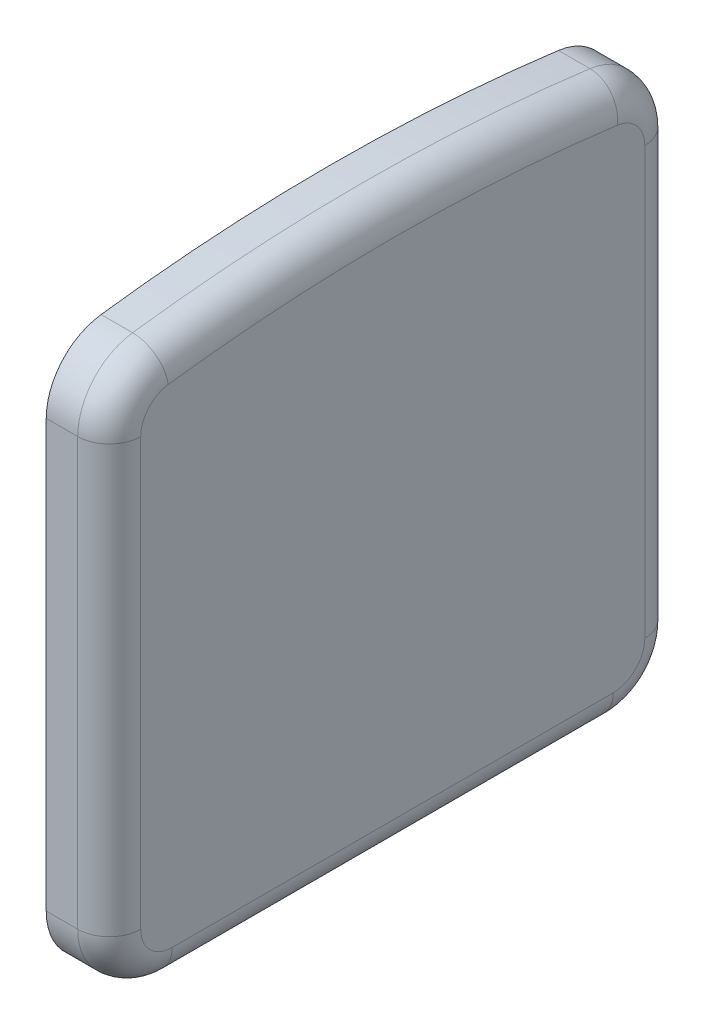
ISO-10303-21;
HEADER;
FILE_DESCRIPTION(('STEP AP214'),'2;1');
FILE_NAME('part.step','',(''),(''),'','','');
FILE_SCHEMA(('AUTOMOTIVE_DESIGN { 1 0 10303 214 1 1 1 1 }'));
ENDSEC;
DATA;
#1=APPLICATION_CONTEXT('core data for automotive mechanical design processes');
#2=APPLICATION_PROTOCOL_DEFINITION('international standard','automotive_design',2000,#1);
#3=PRODUCT_CONTEXT('',#1,'mechanical');
#4=PRODUCT('Part','Part','',(#3));
#5=PRODUCT_RELATED_PRODUCT_CATEGORY('part','',(#4));
#6=PRODUCT_DEFINITION_FORMATION('','',#4);
#7=PRODUCT_DEFINITION_CONTEXT('part definition',#1,'design');
#8=PRODUCT_DEFINITION('design','',#6,#7);
#9=PRODUCT_DEFINITION_SHAPE('','',#8);
#10=(LENGTH_UNIT() NAMED_UNIT(*) SI_UNIT(.MILLI.,.METRE.));
#11=(NAMED_UNIT(*) PLANE_ANGLE_UNIT() SI_UNIT($,.RADIAN.));
#12=(NAMED_UNIT(*) SI_UNIT($,.STERADIAN.) SOLID_ANGLE_UNIT());
#13=UNCERTAINTY_MEASURE_WITH_UNIT(LENGTH_MEASURE(1.E-05),#10,'distance_accuracy_value','');
#14=(GEOMETRIC_REPRESENTATION_CONTEXT(3) GLOBAL_UNCERTAINTY_ASSIGNED_CONTEXT((#13)) GLOBAL_UNIT_ASSIGNED_CONTEXT((#10,
#11,#12)) REPRESENTATION_CONTEXT('',''));
#15=CARTESIAN_POINT('',(0.,0.,0.));
#16=DIRECTION('',(0.,0.,1.));
#17=DIRECTION('',(1.,0.,0.));
#18=AXIS2_PLACEMENT_3D('',#15,#16,#17);
#19=CARTESIAN_POINT('',(14.999,-80.001,-4.50000000000003));
#20=DIRECTION('',(0.,0.,-1.));
#21=DIRECTION('',(0.,1.,0.));
#22=AXIS2_PLACEMENT_3D('',#19,#20,#21);
#23=PLANE('',#22);
#24=DIRECTION('',(0.,-1.,0.));
#25=VECTOR('',#24,1.);
#26=CARTESIAN_POINT('',(15.,-76.3808696074614,-4.50000000000003));
#27=LINE('',#26,#25);
#28=CARTESIAN_POINT('',(15.,-73.2278129395449,-4.50000000000002));
#29=VERTEX_POINT('',#28);
#30=CARTESIAN_POINT('',(15.,-80.,-4.50000000000003));
#31=VERTEX_POINT('',#30);
#32=EDGE_CURVE('E209',#29,#31,#27,.T.);
#33=ORIENTED_EDGE('',*,*,#32,.F.);
#34=DIRECTION('',(-1.,0.,0.));
#35=VECTOR('',#34,1.);
#36=CARTESIAN_POINT('',(15.25,-73.2278129395449,-4.50000000000002));
#37=LINE('',#36,#35);
#38=CARTESIAN_POINT('',(15.5,-73.2278129395449,-4.50000000000003));
#39=VERTEX_POINT('',#38);
#40=EDGE_CURVE('E239',#39,#29,#37,.T.);
#41=ORIENTED_EDGE('',*,*,#40,.F.);
#42=DIRECTION('',(0.,1.,0.));
#43=VECTOR('',#42,1.);
#44=CARTESIAN_POINT('',(15.5,-76.6139064697724,-4.50000000000003));
#45=LINE('',#44,#43);
#46=CARTESIAN_POINT('',(15.5,-80.,-4.50000000000003));
#47=VERTEX_POINT('',#46);
#48=EDGE_CURVE('E192',#47,#39,#45,.T.);
#49=ORIENTED_EDGE('',*,*,#48,.F.);
#50=DIRECTION('',(1.,0.,0.));
#51=VECTOR('',#50,1.);
#52=CARTESIAN_POINT('',(15.25,-80.,-4.50000000000003));
#53=LINE('',#52,#51);
#54=EDGE_CURVE('E198',#31,#47,#53,.T.);
#55=ORIENTED_EDGE('',*,*,#54,.F.);
#56=EDGE_LOOP('',(#33,#41,#49,#55));
#57=FACE_BOUND('',#56,.T.);
#58=ADVANCED_FACE('F17',(#57),#23,.T.);
#59=CARTESIAN_POINT('',(15.5,-73.2278129395449,-3.50000000000007));
#60=DIRECTION('',(-1.,0.,0.));
#61=DIRECTION('',(0.,0.,1.));
#62=AXIS2_PLACEMENT_3D('',#59,#60,#61);
#63=CYLINDRICAL_SURFACE('',#62,0.999999999999983);
#64=CARTESIAN_POINT('',(15.,-73.2278129395449,-3.50000000000007));
#65=DIRECTION('',(-1.,0.,0.));
#66=DIRECTION('',(0.,0.,1.));
#67=AXIS2_PLACEMENT_3D('',#64,#65,#66);
#68=CIRCLE('',#67,0.999999999999983);
#69=CARTESIAN_POINT('',(15.,-72.2362504558243,-3.62962962962966));
#70=VERTEX_POINT('',#69);
#71=EDGE_CURVE('E211',#70,#29,#68,.T.);
#72=ORIENTED_EDGE('',*,*,#71,.F.);
#73=DIRECTION('',(-1.,0.,0.));
#74=VECTOR('',#73,1.);
#75=CARTESIAN_POINT('',(15.25,-72.2362504558243,-3.62962962962965));
#76=LINE('',#75,#74);
#77=CARTESIAN_POINT('',(15.5,-72.2362504558243,-3.62962962962965));
#78=VERTEX_POINT('',#77);
#79=EDGE_CURVE('E232',#78,#70,#76,.T.);
#80=ORIENTED_EDGE('',*,*,#79,.F.);
#81=CARTESIAN_POINT('',(15.5,-73.2278129395449,-3.50000000000007));
#82=DIRECTION('',(1.,0.,0.));
#83=DIRECTION('',(0.,0.,-1.));
#84=AXIS2_PLACEMENT_3D('',#81,#82,#83);
#85=CIRCLE('',#84,0.999999999999983);
#86=EDGE_CURVE('E186',#39,#78,#85,.T.);
#87=ORIENTED_EDGE('',*,*,#86,.F.);
#88=ORIENTED_EDGE('',*,*,#40,.T.);
#89=EDGE_LOOP('',(#72,#80,#87,#88));
#90=FACE_BOUND('',#89,.T.);
#91=ADVANCED_FACE('F332',(#90),#63,.T.);
#92=CARTESIAN_POINT('',(15.5,-100.000000000005,0.));
#93=DIRECTION('',(-1.,0.,0.));
#94=DIRECTION('',(0.,0.,1.));
#95=AXIS2_PLACEMENT_3D('',#92,#93,#94);
#96=CYLINDRICAL_SURFACE('',#95,28.0000000000055);
#97=CARTESIAN_POINT('',(15.,-100.000000000005,0.));
#98=DIRECTION('',(-1.,0.,0.));
#99=DIRECTION('',(0.,0.,1.));
#100=AXIS2_PLACEMENT_3D('',#97,#98,#99);
#101=CIRCLE('',#100,28.0000000000055);
#102=CARTESIAN_POINT('',(15.,-72.2362504558243,3.62962962962961));
#103=VERTEX_POINT('',#102);
#104=EDGE_CURVE('E252',#103,#70,#101,.T.);
#105=ORIENTED_EDGE('',*,*,#104,.F.);
#106=DIRECTION('',(-1.,0.,0.));
#107=VECTOR('',#106,1.);
#108=CARTESIAN_POINT('',(15.25,-72.2362504558243,3.6296296296296));
#109=LINE('',#108,#107);
#110=CARTESIAN_POINT('',(15.5,-72.2362504558243,3.6296296296296));
#111=VERTEX_POINT('',#110);
#112=EDGE_CURVE('E225',#111,#103,#109,.T.);
#113=ORIENTED_EDGE('',*,*,#112,.F.);
#114=CARTESIAN_POINT('',(15.5,-99.9999999999999,0.));
#115=DIRECTION('',(1.,0.,0.));
#116=DIRECTION('',(0.,0.991562483720559,-0.129629629629632));
#117=AXIS2_PLACEMENT_3D('',#114,#115,#116);
#118=CIRCLE('',#117,27.9999999999999);
#119=EDGE_CURVE('E180',#78,#111,#118,.T.);
#120=ORIENTED_EDGE('',*,*,#119,.F.);
#121=ORIENTED_EDGE('',*,*,#79,.T.);
#122=EDGE_LOOP('',(#105,#113,#120,#121));
#123=FACE_BOUND('',#122,.T.);
#124=ADVANCED_FACE('F328',(#123),#96,.T.);
#125=CARTESIAN_POINT('',(15.5,-73.2278129395449,3.50000000000002));
#126=DIRECTION('',(-1.,0.,0.));
#127=DIRECTION('',(0.,0.,1.));
#128=AXIS2_PLACEMENT_3D('',#125,#126,#127);
#129=CYLINDRICAL_SURFACE('',#128,0.999999999999992);
#130=CARTESIAN_POINT('',(15.,-73.2278129395449,3.50000000000002));
#131=DIRECTION('',(-1.,0.,0.));
#132=DIRECTION('',(0.,0.,1.));
#133=AXIS2_PLACEMENT_3D('',#130,#131,#132);
#134=CIRCLE('',#133,0.999999999999992);
#135=CARTESIAN_POINT('',(15.,-73.2278129395449,4.49999999999997));
#136=VERTEX_POINT('',#135);
#137=EDGE_CURVE('E215',#136,#103,#134,.T.);
#138=ORIENTED_EDGE('',*,*,#137,.F.);
#139=DIRECTION('',(-1.,0.,0.));
#140=VECTOR('',#139,1.);
#141=CARTESIAN_POINT('',(15.25,-73.2278129395449,4.49999999999997));
#142=LINE('',#141,#140);
#143=CARTESIAN_POINT('',(15.5,-73.2278129395449,4.49999999999997));
#144=VERTEX_POINT('',#143);
#145=EDGE_CURVE('E218',#144,#136,#142,.T.);
#146=ORIENTED_EDGE('',*,*,#145,.F.);
#147=CARTESIAN_POINT('',(15.5,-73.2278129395449,3.49999999999989));
#148=DIRECTION('',(1.,0.,0.));
#149=DIRECTION('',(0.,0.99156248372055,0.129629629629703));
#150=AXIS2_PLACEMENT_3D('',#147,#148,#149);
#151=CIRCLE('',#150,1.00000000000006);
#152=EDGE_CURVE('E176',#111,#144,#151,.T.);
#153=ORIENTED_EDGE('',*,*,#152,.F.);
#154=ORIENTED_EDGE('',*,*,#112,.T.);
#155=EDGE_LOOP('',(#138,#146,#153,#154));
#156=FACE_BOUND('',#155,.T.);
#157=ADVANCED_FACE('F324',(#156),#129,.T.);
#158=CARTESIAN_POINT('',(14.999,-73.2268129395449,4.49999999999997));
#159=DIRECTION('',(0.,0.,1.));
#160=DIRECTION('',(0.,-1.,0.));
#161=AXIS2_PLACEMENT_3D('',#158,#159,#160);
#162=PLANE('',#161);
#163=DIRECTION('',(0.,1.,0.));
#164=VECTOR('',#163,1.);
#165=CARTESIAN_POINT('',(15.,-76.3808696074614,4.49999999999997));
#166=LINE('',#165,#164);
#167=CARTESIAN_POINT('',(15.,-80.,4.49999999999997));
#168=VERTEX_POINT('',#167);
#169=EDGE_CURVE('E212',#168,#136,#166,.T.);
#170=ORIENTED_EDGE('',*,*,#169,.F.);
#171=DIRECTION('',(-1.,0.,0.));
#172=VECTOR('',#171,1.);
#173=CARTESIAN_POINT('',(15.25,-80.,4.49999999999997));
#174=LINE('',#173,#172);
#175=CARTESIAN_POINT('',(15.5,-80.,4.49999999999997));
#176=VERTEX_POINT('',#175);
#177=EDGE_CURVE('E216',#176,#168,#174,.T.);
#178=ORIENTED_EDGE('',*,*,#177,.F.);
#179=DIRECTION('',(0.,-1.,0.));
#180=VECTOR('',#179,1.);
#181=CARTESIAN_POINT('',(15.5,-76.6139064697725,4.49999999999997));
#182=LINE('',#181,#180);
#183=EDGE_CURVE('E172',#144,#176,#182,.T.);
#184=ORIENTED_EDGE('',*,*,#183,.F.);
#185=ORIENTED_EDGE('',*,*,#145,.T.);
#186=EDGE_LOOP('',(#170,#178,#184,#185));
#187=FACE_BOUND('',#186,.T.);
#188=ADVANCED_FACE('F321',(#187),#162,.T.);
#189=CARTESIAN_POINT('',(15.5,-80.,3.49999999999997));
#190=DIRECTION('',(-1.,0.,0.));
#191=DIRECTION('',(0.,0.,1.));
#192=AXIS2_PLACEMENT_3D('',#189,#190,#191);
#193=CYLINDRICAL_SURFACE('',#192,1.);
#194=CARTESIAN_POINT('',(15.,-80.,3.49999999999997));
#195=DIRECTION('',(-1.,0.,0.));
#196=DIRECTION('',(0.,0.,1.));
#197=AXIS2_PLACEMENT_3D('',#194,#195,#196);
#198=CIRCLE('',#197,1.);
#199=CARTESIAN_POINT('',(15.,-81.,3.49999999999997));
#200=VERTEX_POINT('',#199);
#201=EDGE_CURVE('E126',#200,#168,#198,.T.);
#202=ORIENTED_EDGE('',*,*,#201,.F.);
#203=DIRECTION('',(-1.,0.,0.));
#204=VECTOR('',#203,1.);
#205=CARTESIAN_POINT('',(15.25,-81.,3.49999999999997));
#206=LINE('',#205,#204);
#207=CARTESIAN_POINT('',(15.5,-81.,3.49999999999997));
#208=VERTEX_POINT('',#207);
#209=EDGE_CURVE('E121',#208,#200,#206,.T.);
#210=ORIENTED_EDGE('',*,*,#209,.F.);
#211=CARTESIAN_POINT('',(15.5,-80.,3.49999999999998));
#212=DIRECTION('',(1.,0.,0.));
#213=DIRECTION('',(0.,0.,1.));
#214=AXIS2_PLACEMENT_3D('',#211,#212,#213);
#215=CIRCLE('',#214,0.999999999999982);
#216=EDGE_CURVE('E124',#176,#208,#215,.T.);
#217=ORIENTED_EDGE('',*,*,#216,.F.);
#218=ORIENTED_EDGE('',*,*,#177,.T.);
#219=EDGE_LOOP('',(#202,#210,#217,#218));
#220=FACE_BOUND('',#219,.T.);
#221=ADVANCED_FACE('F123',(#220),#193,.T.);
#222=CARTESIAN_POINT('',(15.,-81.001,4.50099999999998));
#223=DIRECTION('',(-1.,0.,0.));
#224=DIRECTION('',(0.,1.,0.));
#225=AXIS2_PLACEMENT_3D('',#222,#223,#224);
#226=PLANE('',#225);
#227=CARTESIAN_POINT('',(15.,-80.,-3.50000000000006));
#228=DIRECTION('',(-1.,0.,0.));
#229=DIRECTION('',(0.,0.,1.));
#230=AXIS2_PLACEMENT_3D('',#227,#228,#229);
#231=CIRCLE('',#230,0.999999999999975);
#232=CARTESIAN_POINT('',(15.,-81.,-3.50000000000005));
#233=VERTEX_POINT('',#232);
#234=EDGE_CURVE('E201',#233,#31,#231,.F.);
#235=ORIENTED_EDGE('',*,*,#234,.F.);
#236=DIRECTION('',(0.,0.,-1.));
#237=VECTOR('',#236,1.);
#238=CARTESIAN_POINT('',(15.,-81.,0.));
#239=LINE('',#238,#237);
#240=EDGE_CURVE('E131',#200,#233,#239,.T.);
#241=ORIENTED_EDGE('',*,*,#240,.F.);
#242=ORIENTED_EDGE('',*,*,#201,.T.);
#243=ORIENTED_EDGE('',*,*,#169,.T.);
#244=ORIENTED_EDGE('',*,*,#137,.T.);
#245=ORIENTED_EDGE('',*,*,#104,.T.);
#246=ORIENTED_EDGE('',*,*,#71,.T.);
#247=ORIENTED_EDGE('',*,*,#32,.T.);
#248=EDGE_LOOP('',(#235,#241,#242,#243,#244,#245,#246,#247));
#249=FACE_BOUND('',#248,.T.);
#250=ADVANCED_FACE('F315',(#249),#226,.T.);
#251=CARTESIAN_POINT('',(15.5,-80.,-3.50000000000006));
#252=DIRECTION('',(-1.,0.,0.));
#253=DIRECTION('',(0.,0.,1.));
#254=AXIS2_PLACEMENT_3D('',#251,#252,#253);
#255=CYLINDRICAL_SURFACE('',#254,0.999999999999975);
#256=ORIENTED_EDGE('',*,*,#234,.T.);
#257=ORIENTED_EDGE('',*,*,#54,.T.);
#258=CARTESIAN_POINT('',(15.5,-80.,-3.50000000000005));
#259=DIRECTION('',(1.,0.,0.));
#260=DIRECTION('',(0.,-1.,0.));
#261=AXIS2_PLACEMENT_3D('',#258,#259,#260);
#262=CIRCLE('',#261,0.999999999999976);
#263=CARTESIAN_POINT('',(15.5,-81.,-3.50000000000003));
#264=VERTEX_POINT('',#263);
#265=EDGE_CURVE('E156',#264,#47,#262,.T.);
#266=ORIENTED_EDGE('',*,*,#265,.F.);
#267=DIRECTION('',(1.,0.,0.));
#268=VECTOR('',#267,1.);
#269=CARTESIAN_POINT('',(15.25,-81.,-3.50000000000003));
#270=LINE('',#269,#268);
#271=EDGE_CURVE('E144',#233,#264,#270,.T.);
#272=ORIENTED_EDGE('',*,*,#271,.F.);
#273=EDGE_LOOP('',(#256,#257,#266,#272));
#274=FACE_BOUND('',#273,.T.);
#275=ADVANCED_FACE('F277',(#274),#255,.T.);
#276=CARTESIAN_POINT('',(15.5,-73.2278129395449,-4.00000000000003));
#277=DIRECTION('',(0.,-1.,0.));
#278=DIRECTION('',(0.,0.,-1.));
#279=AXIS2_PLACEMENT_3D('',#276,#277,#278);
#280=CYLINDRICAL_SURFACE('',#279,0.5);
#281=CARTESIAN_POINT('',(15.5,-80.,-4.00000000000003));
#282=DIRECTION('',(0.,-1.,0.));
#283=DIRECTION('',(1.,0.,0.));
#284=AXIS2_PLACEMENT_3D('',#281,#282,#283);
#285=CIRCLE('',#284,0.500000000000001);
#286=CARTESIAN_POINT('',(16.,-80.,-4.00000000000003));
#287=VERTEX_POINT('',#286);
#288=EDGE_CURVE('E159',#47,#287,#285,.T.);
#289=ORIENTED_EDGE('',*,*,#288,.F.);
#290=ORIENTED_EDGE('',*,*,#48,.T.);
#291=CARTESIAN_POINT('',(15.5,-73.2278129395449,-4.00000000000002));
#292=DIRECTION('',(0.,1.,0.));
#293=DIRECTION('',(1.,0.,0.));
#294=AXIS2_PLACEMENT_3D('',#291,#292,#293);
#295=CIRCLE('',#294,0.500000000000001);
#296=CARTESIAN_POINT('',(16.,-73.2278129395449,-4.00000000000002));
#297=VERTEX_POINT('',#296);
#298=EDGE_CURVE('E189',#297,#39,#295,.T.);
#299=ORIENTED_EDGE('',*,*,#298,.F.);
#300=DIRECTION('',(0.,1.,0.));
#301=VECTOR('',#300,1.);
#302=CARTESIAN_POINT('',(16.,-76.3829969358996,-4.00000000000003));
#303=LINE('',#302,#301);
#304=EDGE_CURVE('E260',#287,#297,#303,.T.);
#305=ORIENTED_EDGE('',*,*,#304,.F.);
#306=EDGE_LOOP('',(#289,#290,#299,#305));
#307=FACE_BOUND('',#306,.T.);
#308=ADVANCED_FACE('F283',(#307),#280,.T.);
#309=CARTESIAN_POINT('',(15.5,-73.2278129395449,-3.49999999999998));
#310=DIRECTION('',(1.,0.,0.));
#311=DIRECTION('',(0.,0.,-1.));
#312=AXIS2_PLACEMENT_3D('',#309,#310,#311);
#313=TOROIDAL_SURFACE('',#312,0.500000000000046,0.500000000000001);
#314=ORIENTED_EDGE('',*,*,#298,.T.);
#315=ORIENTED_EDGE('',*,*,#86,.T.);
#316=CARTESIAN_POINT('',(15.5,-72.7320316976846,-3.56481481481484));
#317=DIRECTION('',(0.,0.129629629629622,0.991562483720561));
#318=DIRECTION('',(1.,0.,0.));
#319=AXIS2_PLACEMENT_3D('',#316,#317,#318);
#320=CIRCLE('',#319,0.499999999999991);
#321=CARTESIAN_POINT('',(16.,-72.7320316976846,-3.56481481481481));
#322=VERTEX_POINT('',#321);
#323=EDGE_CURVE('E183',#322,#78,#320,.T.);
#324=ORIENTED_EDGE('',*,*,#323,.F.);
#325=CARTESIAN_POINT('',(16.,-73.2278129395449,-3.49999999999998));
#326=DIRECTION('',(1.,0.,0.));
#327=DIRECTION('',(0.,0.,-1.));
#328=AXIS2_PLACEMENT_3D('',#325,#326,#327);
#329=CIRCLE('',#328,0.500000000000046);
#330=EDGE_CURVE('E261',#297,#322,#329,.T.);
#331=ORIENTED_EDGE('',*,*,#330,.F.);
#332=EDGE_LOOP('',(#314,#315,#324,#331));
#333=FACE_BOUND('',#332,.T.);
#334=ADVANCED_FACE('F307',(#333),#313,.T.);
#335=CARTESIAN_POINT('',(15.4999999999998,-100.000000000007,0.));
#336=DIRECTION('',(1.,0.,0.));
#337=DIRECTION('',(0.,1.,0.));
#338=AXIS2_PLACEMENT_3D('',#335,#336,#337);
#339=TOROIDAL_SURFACE('',#338,27.5000000000073,0.499999999999991);
#340=ORIENTED_EDGE('',*,*,#323,.T.);
#341=ORIENTED_EDGE('',*,*,#119,.T.);
#342=CARTESIAN_POINT('',(15.5,-72.7320316976846,3.56481481481478));
#343=DIRECTION('',(0.,-0.129629629629642,0.991562483720558));
#344=DIRECTION('',(1.,0.,0.));
#345=AXIS2_PLACEMENT_3D('',#342,#343,#344);
#346=CIRCLE('',#345,0.499999999999994);
#347=CARTESIAN_POINT('',(16.,-72.7320316976846,3.56481481481475));
#348=VERTEX_POINT('',#347);
#349=EDGE_CURVE('E59',#348,#111,#346,.T.);
#350=ORIENTED_EDGE('',*,*,#349,.F.);
#351=CARTESIAN_POINT('',(16.,-100.000000000007,0.));
#352=DIRECTION('',(1.,0.,0.));
#353=DIRECTION('',(0.,1.,0.));
#354=AXIS2_PLACEMENT_3D('',#351,#352,#353);
#355=CIRCLE('',#354,27.5000000000073);
#356=EDGE_CURVE('E263',#322,#348,#355,.T.);
#357=ORIENTED_EDGE('',*,*,#356,.F.);
#358=EDGE_LOOP('',(#340,#341,#350,#357));
#359=FACE_BOUND('',#358,.T.);
#360=ADVANCED_FACE('F304',(#359),#339,.T.);
#361=CARTESIAN_POINT('',(15.5,-73.2278129395449,3.49999999999991));
#362=DIRECTION('',(1.,0.,0.));
#363=DIRECTION('',(0.,0.,-1.));
#364=AXIS2_PLACEMENT_3D('',#361,#362,#363);
#365=TOROIDAL_SURFACE('',#364,0.500000000000051,0.499999999999994);
#366=CARTESIAN_POINT('',(15.5,-73.2278129395449,3.99999999999997));
#367=DIRECTION('',(0.,-1.,0.));
#368=DIRECTION('',(1.,0.,0.));
#369=AXIS2_PLACEMENT_3D('',#366,#367,#368);
#370=CIRCLE('',#369,0.5);
#371=CARTESIAN_POINT('',(16.,-73.2278129395449,3.99999999999997));
#372=VERTEX_POINT('',#371);
#373=EDGE_CURVE('E66',#372,#144,#370,.T.);
#374=ORIENTED_EDGE('',*,*,#373,.F.);
#375=CARTESIAN_POINT('',(16.,-73.2278129395449,3.49999999999991));
#376=DIRECTION('',(1.,0.,0.));
#377=DIRECTION('',(0.,0.,-1.));
#378=AXIS2_PLACEMENT_3D('',#375,#376,#377);
#379=CIRCLE('',#378,0.500000000000051);
#380=EDGE_CURVE('E21',#348,#372,#379,.T.);
#381=ORIENTED_EDGE('',*,*,#380,.F.);
#382=ORIENTED_EDGE('',*,*,#349,.T.);
#383=ORIENTED_EDGE('',*,*,#152,.T.);
#384=EDGE_LOOP('',(#374,#381,#382,#383));
#385=FACE_BOUND('',#384,.T.);
#386=ADVANCED_FACE('F301',(#385),#365,.T.);
#387=CARTESIAN_POINT('',(15.5,-80.,3.99999999999997));
#388=DIRECTION('',(0.,1.,0.));
#389=DIRECTION('',(0.,0.,1.));
#390=AXIS2_PLACEMENT_3D('',#387,#388,#389);
#391=CYLINDRICAL_SURFACE('',#390,0.5);
#392=CARTESIAN_POINT('',(15.5,-80.,3.99999999999997));
#393=DIRECTION('',(0.,-1.,0.));
#394=DIRECTION('',(1.,0.,0.));
#395=AXIS2_PLACEMENT_3D('',#392,#393,#394);
#396=CIRCLE('',#395,0.500000000000002);
#397=CARTESIAN_POINT('',(16.,-80.,3.99999999999997));
#398=VERTEX_POINT('',#397);
#399=EDGE_CURVE('E72',#398,#176,#396,.T.);
#400=ORIENTED_EDGE('',*,*,#399,.F.);
#401=DIRECTION('',(0.,-1.,0.));
#402=VECTOR('',#401,1.);
#403=CARTESIAN_POINT('',(16.,-76.3829969358996,3.99999999999997));
#404=LINE('',#403,#402);
#405=EDGE_CURVE('E150',#372,#398,#404,.T.);
#406=ORIENTED_EDGE('',*,*,#405,.F.);
#407=ORIENTED_EDGE('',*,*,#373,.T.);
#408=ORIENTED_EDGE('',*,*,#183,.T.);
#409=EDGE_LOOP('',(#400,#406,#407,#408));
#410=FACE_BOUND('',#409,.T.);
#411=ADVANCED_FACE('F298',(#410),#391,.T.);
#412=CARTESIAN_POINT('',(15.5,-80.,3.49999999999998));
#413=DIRECTION('',(1.,0.,0.));
#414=DIRECTION('',(0.,0.,-1.));
#415=AXIS2_PLACEMENT_3D('',#412,#413,#414);
#416=DEGENERATE_TOROIDAL_SURFACE('',#415,0.49999999999999,0.500000000000002,.T.);
#417=CARTESIAN_POINT('',(15.5,-80.5,3.49999999999997));
#418=DIRECTION('',(0.,0.,-1.));
#419=DIRECTION('',(1.,0.,0.));
#420=AXIS2_PLACEMENT_3D('',#417,#418,#419);
#421=CIRCLE('',#420,0.5);
#422=CARTESIAN_POINT('',(16.,-80.5,3.49999999999997));
#423=VERTEX_POINT('',#422);
#424=EDGE_CURVE('E136',#423,#208,#421,.T.);
#425=ORIENTED_EDGE('',*,*,#424,.F.);
#426=CARTESIAN_POINT('',(16.,-80.,3.49999999999998));
#427=DIRECTION('',(1.,0.,0.));
#428=DIRECTION('',(0.,0.,-1.));
#429=AXIS2_PLACEMENT_3D('',#426,#427,#428);
#430=CIRCLE('',#429,0.49999999999999);
#431=EDGE_CURVE('E148',#398,#423,#430,.T.);
#432=ORIENTED_EDGE('',*,*,#431,.F.);
#433=ORIENTED_EDGE('',*,*,#399,.T.);
#434=ORIENTED_EDGE('',*,*,#216,.T.);
#435=EDGE_LOOP('',(#425,#432,#433,#434));
#436=FACE_BOUND('',#435,.T.);
#437=ADVANCED_FACE('F134',(#436),#416,.T.);
#438=CARTESIAN_POINT('',(14.999,-81.,3.50099999999997));
#439=DIRECTION('',(0.,-1.,0.));
#440=DIRECTION('',(0.,0.,-1.));
#441=AXIS2_PLACEMENT_3D('',#438,#439,#440);
#442=PLANE('',#441);
#443=ORIENTED_EDGE('',*,*,#240,.T.);
#444=ORIENTED_EDGE('',*,*,#271,.T.);
#445=DIRECTION('',(0.,0.,-1.));
#446=VECTOR('',#445,1.);
#447=CARTESIAN_POINT('',(15.5,-81.,0.));
#448=LINE('',#447,#446);
#449=EDGE_CURVE('E141',#208,#264,#448,.T.);
#450=ORIENTED_EDGE('',*,*,#449,.F.);
#451=ORIENTED_EDGE('',*,*,#209,.T.);
#452=EDGE_LOOP('',(#443,#444,#450,#451));
#453=FACE_BOUND('',#452,.T.);
#454=ADVANCED_FACE('F142',(#453),#442,.T.);
#455=CARTESIAN_POINT('',(15.5,-80.,-3.50000000000005));
#456=DIRECTION('',(1.,0.,0.));
#457=DIRECTION('',(0.,0.,-1.));
#458=AXIS2_PLACEMENT_3D('',#455,#456,#457);
#459=DEGENERATE_TOROIDAL_SURFACE('',#458,0.499999999999987,0.500000000000004,.T.);
#460=CARTESIAN_POINT('',(15.5,-80.5,-3.50000000000003));
#461=DIRECTION('',(0.,0.,1.));
#462=DIRECTION('',(1.,0.,0.));
#463=AXIS2_PLACEMENT_3D('',#460,#461,#462);
#464=CIRCLE('',#463,0.5);
#465=CARTESIAN_POINT('',(16.,-80.5,-3.50000000000004));
#466=VERTEX_POINT('',#465);
#467=EDGE_CURVE('E27',#264,#466,#464,.T.);
#468=ORIENTED_EDGE('',*,*,#467,.F.);
#469=ORIENTED_EDGE('',*,*,#265,.T.);
#470=ORIENTED_EDGE('',*,*,#288,.T.);
#471=CARTESIAN_POINT('',(16.,-80.,-3.50000000000005));
#472=DIRECTION('',(1.,0.,0.));
#473=DIRECTION('',(0.,0.,-1.));
#474=AXIS2_PLACEMENT_3D('',#471,#472,#473);
#475=CIRCLE('',#474,0.499999999999987);
#476=EDGE_CURVE('E36',#466,#287,#475,.T.);
#477=ORIENTED_EDGE('',*,*,#476,.F.);
#478=EDGE_LOOP('',(#468,#469,#470,#477));
#479=FACE_BOUND('',#478,.T.);
#480=ADVANCED_FACE('F273',(#479),#459,.T.);
#481=CARTESIAN_POINT('',(16.,-72.2649938717992,4.00099999999999));
#482=DIRECTION('',(1.,0.,0.));
#483=DIRECTION('',(0.,-1.,0.));
#484=AXIS2_PLACEMENT_3D('',#481,#482,#483);
#485=PLANE('',#484);
#486=ORIENTED_EDGE('',*,*,#405,.T.);
#487=ORIENTED_EDGE('',*,*,#431,.T.);
#488=DIRECTION('',(0.,0.,1.));
#489=VECTOR('',#488,1.);
#490=CARTESIAN_POINT('',(16.,-80.5,0.));
#491=LINE('',#490,#489);
#492=EDGE_CURVE('E11',#466,#423,#491,.T.);
#493=ORIENTED_EDGE('',*,*,#492,.F.);
#494=ORIENTED_EDGE('',*,*,#476,.T.);
#495=ORIENTED_EDGE('',*,*,#304,.T.);
#496=ORIENTED_EDGE('',*,*,#330,.T.);
#497=ORIENTED_EDGE('',*,*,#356,.T.);
#498=ORIENTED_EDGE('',*,*,#380,.T.);
#499=EDGE_LOOP('',(#486,#487,#493,#494,#495,#496,#497,#498));
#500=FACE_BOUND('',#499,.T.);
#501=ADVANCED_FACE('F285',(#500),#485,.T.);
#502=CARTESIAN_POINT('',(15.5,-80.5,-3.50000000000003));
#503=DIRECTION('',(0.,0.,1.));
#504=DIRECTION('',(1.,0.,0.));
#505=AXIS2_PLACEMENT_3D('',#502,#503,#504);
#506=CYLINDRICAL_SURFACE('',#505,0.5);
#507=ORIENTED_EDGE('',*,*,#467,.T.);
#508=ORIENTED_EDGE('',*,*,#492,.T.);
#509=ORIENTED_EDGE('',*,*,#424,.T.);
#510=ORIENTED_EDGE('',*,*,#449,.T.);
#511=EDGE_LOOP('',(#507,#508,#509,#510));
#512=FACE_BOUND('',#511,.T.);
#513=ADVANCED_FACE('F19',(#512),#506,.T.);
#514=CLOSED_SHELL('',(#58,#91,#124,#157,#188,#221,#250,#275,#308,#334,#360,#386,#411,#437,#454,
#480,#501,#513));
#515=MANIFOLD_SOLID_BREP('B1',#514);
#516=ADVANCED_BREP_SHAPE_REPRESENTATION('',(#18,#515),#14);
#517=SHAPE_DEFINITION_REPRESENTATION(#9,#516);
ENDSEC;
END-ISO-10303-21;
